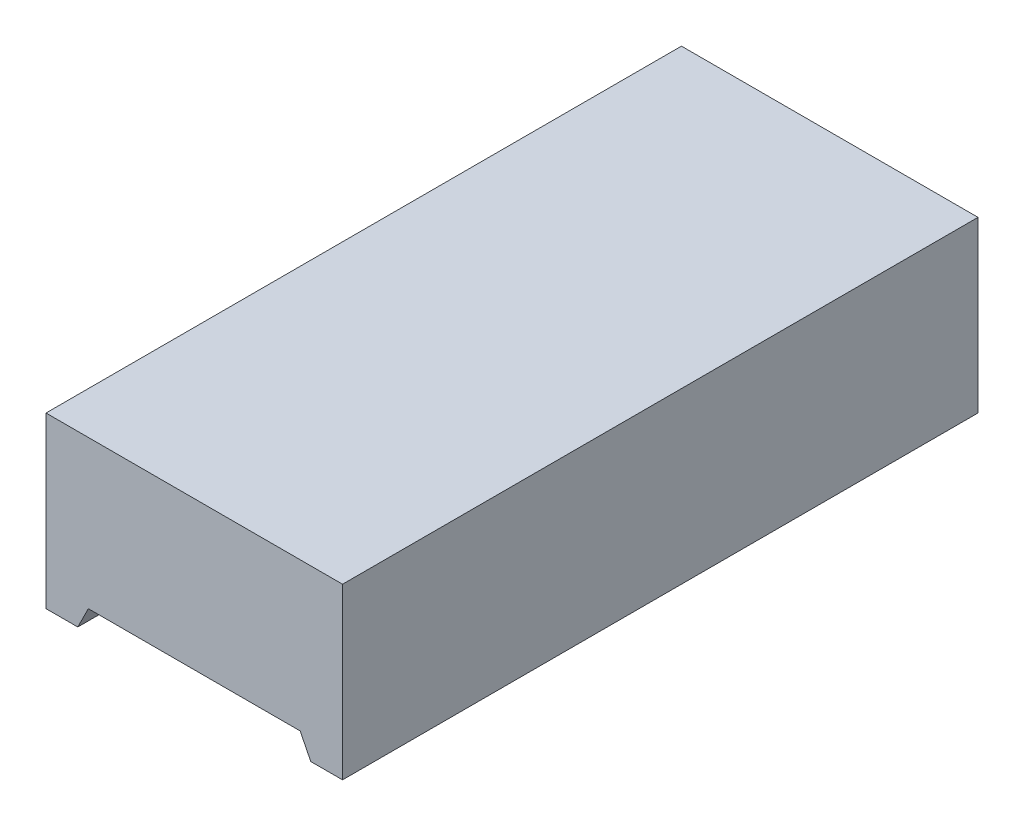
ISO-10303-21;
HEADER;
FILE_DESCRIPTION(('STEP AP214'),'2;1');
FILE_NAME('part.step','',(''),(''),'','','');
FILE_SCHEMA(('AUTOMOTIVE_DESIGN { 1 0 10303 214 1 1 1 1 }'));
ENDSEC;
DATA;
#1=APPLICATION_CONTEXT('core data for automotive mechanical design processes');
#2=APPLICATION_PROTOCOL_DEFINITION('international standard','automotive_design',2000,#1);
#3=PRODUCT_CONTEXT('',#1,'mechanical');
#4=PRODUCT('Part','Part','',(#3));
#5=PRODUCT_RELATED_PRODUCT_CATEGORY('part','',(#4));
#6=PRODUCT_DEFINITION_FORMATION('','',#4);
#7=PRODUCT_DEFINITION_CONTEXT('part definition',#1,'design');
#8=PRODUCT_DEFINITION('design','',#6,#7);
#9=PRODUCT_DEFINITION_SHAPE('','',#8);
#10=(LENGTH_UNIT() NAMED_UNIT(*) SI_UNIT(.MILLI.,.METRE.));
#11=(NAMED_UNIT(*) PLANE_ANGLE_UNIT() SI_UNIT($,.RADIAN.));
#12=(NAMED_UNIT(*) SI_UNIT($,.STERADIAN.) SOLID_ANGLE_UNIT());
#13=UNCERTAINTY_MEASURE_WITH_UNIT(LENGTH_MEASURE(1.E-05),#10,'distance_accuracy_value','');
#14=(GEOMETRIC_REPRESENTATION_CONTEXT(3) GLOBAL_UNCERTAINTY_ASSIGNED_CONTEXT((#13)) GLOBAL_UNIT_ASSIGNED_CONTEXT((#10,
#11,#12)) REPRESENTATION_CONTEXT('',''));
#15=CARTESIAN_POINT('',(0.,0.,0.));
#16=DIRECTION('',(0.,0.,1.));
#17=DIRECTION('',(1.,0.,0.));
#18=AXIS2_PLACEMENT_3D('',#15,#16,#17);
#19=CARTESIAN_POINT('',(7.,0.,15.));
#20=DIRECTION('',(0.,1.,0.));
#21=DIRECTION('',(-1.,0.,0.));
#22=AXIS2_PLACEMENT_3D('',#19,#20,#21);
#23=PLANE('',#22);
#24=DIRECTION('',(1.,0.,0.));
#25=VECTOR('',#24,1.);
#26=CARTESIAN_POINT('',(7.,0.,-15.));
#27=LINE('',#26,#25);
#28=CARTESIAN_POINT('',(5.5,0.,-15.));
#29=VERTEX_POINT('',#28);
#30=CARTESIAN_POINT('',(7.,0.,-15.));
#31=VERTEX_POINT('',#30);
#32=EDGE_CURVE('E130',#29,#31,#27,.T.);
#33=ORIENTED_EDGE('',*,*,#32,.T.);
#34=DIRECTION('',(0.,0.,-1.));
#35=VECTOR('',#34,1.);
#36=CARTESIAN_POINT('',(7.,0.,15.));
#37=LINE('',#36,#35);
#38=CARTESIAN_POINT('',(7.,0.,15.));
#39=VERTEX_POINT('',#38);
#40=EDGE_CURVE('E11',#39,#31,#37,.T.);
#41=ORIENTED_EDGE('',*,*,#40,.F.);
#42=DIRECTION('',(1.,0.,0.));
#43=VECTOR('',#42,1.);
#44=CARTESIAN_POINT('',(7.,0.,15.));
#45=LINE('',#44,#43);
#46=CARTESIAN_POINT('',(5.5,0.,15.));
#47=VERTEX_POINT('',#46);
#48=EDGE_CURVE('E144',#47,#39,#45,.T.);
#49=ORIENTED_EDGE('',*,*,#48,.F.);
#50=DIRECTION('',(0.,0.,-1.));
#51=VECTOR('',#50,1.);
#52=CARTESIAN_POINT('',(5.5,0.,15.));
#53=LINE('',#52,#51);
#54=EDGE_CURVE('E126',#47,#29,#53,.T.);
#55=ORIENTED_EDGE('',*,*,#54,.T.);
#56=EDGE_LOOP('',(#33,#41,#49,#55));
#57=FACE_BOUND('',#56,.T.);
#58=ADVANCED_FACE('F34',(#57),#23,.F.);
#59=CARTESIAN_POINT('',(7.,0.,15.));
#60=DIRECTION('',(-1.,0.,0.));
#61=DIRECTION('',(0.,-1.,0.));
#62=AXIS2_PLACEMENT_3D('',#59,#60,#61);
#63=PLANE('',#62);
#64=DIRECTION('',(0.,1.,0.));
#65=VECTOR('',#64,1.);
#66=CARTESIAN_POINT('',(7.,0.,-15.));
#67=LINE('',#66,#65);
#68=CARTESIAN_POINT('',(7.,8.,-15.));
#69=VERTEX_POINT('',#68);
#70=EDGE_CURVE('E133',#31,#69,#67,.T.);
#71=ORIENTED_EDGE('',*,*,#70,.T.);
#72=DIRECTION('',(0.,0.,-1.));
#73=VECTOR('',#72,1.);
#74=CARTESIAN_POINT('',(7.,8.,15.));
#75=LINE('',#74,#73);
#76=CARTESIAN_POINT('',(7.,8.,15.));
#77=VERTEX_POINT('',#76);
#78=EDGE_CURVE('E42',#77,#69,#75,.T.);
#79=ORIENTED_EDGE('',*,*,#78,.F.);
#80=DIRECTION('',(0.,1.,0.));
#81=VECTOR('',#80,1.);
#82=CARTESIAN_POINT('',(7.,0.,15.));
#83=LINE('',#82,#81);
#84=EDGE_CURVE('E93',#39,#77,#83,.T.);
#85=ORIENTED_EDGE('',*,*,#84,.F.);
#86=ORIENTED_EDGE('',*,*,#40,.T.);
#87=EDGE_LOOP('',(#71,#79,#85,#86));
#88=FACE_BOUND('',#87,.T.);
#89=ADVANCED_FACE('F179',(#88),#63,.F.);
#90=CARTESIAN_POINT('',(7.,8.,15.));
#91=DIRECTION('',(0.,-1.,0.));
#92=DIRECTION('',(0.,0.,-1.));
#93=AXIS2_PLACEMENT_3D('',#90,#91,#92);
#94=PLANE('',#93);
#95=DIRECTION('',(-1.,0.,0.));
#96=VECTOR('',#95,1.);
#97=CARTESIAN_POINT('',(7.,8.,-15.));
#98=LINE('',#97,#96);
#99=CARTESIAN_POINT('',(-7.,8.,-15.));
#100=VERTEX_POINT('',#99);
#101=EDGE_CURVE('E135',#69,#100,#98,.T.);
#102=ORIENTED_EDGE('',*,*,#101,.T.);
#103=DIRECTION('',(0.,0.,-1.));
#104=VECTOR('',#103,1.);
#105=CARTESIAN_POINT('',(-7.,8.,15.));
#106=LINE('',#105,#104);
#107=CARTESIAN_POINT('',(-7.,8.,15.));
#108=VERTEX_POINT('',#107);
#109=EDGE_CURVE('E151',#108,#100,#106,.T.);
#110=ORIENTED_EDGE('',*,*,#109,.F.);
#111=DIRECTION('',(-1.,0.,0.));
#112=VECTOR('',#111,1.);
#113=CARTESIAN_POINT('',(7.,8.,15.));
#114=LINE('',#113,#112);
#115=EDGE_CURVE('E159',#77,#108,#114,.T.);
#116=ORIENTED_EDGE('',*,*,#115,.F.);
#117=ORIENTED_EDGE('',*,*,#78,.T.);
#118=EDGE_LOOP('',(#102,#110,#116,#117));
#119=FACE_BOUND('',#118,.T.);
#120=ADVANCED_FACE('F157',(#119),#94,.F.);
#121=CARTESIAN_POINT('',(-7.,0.,15.));
#122=DIRECTION('',(1.,0.,0.));
#123=DIRECTION('',(0.,1.,0.));
#124=AXIS2_PLACEMENT_3D('',#121,#122,#123);
#125=PLANE('',#124);
#126=DIRECTION('',(0.,-1.,0.));
#127=VECTOR('',#126,1.);
#128=CARTESIAN_POINT('',(-7.,0.,-15.));
#129=LINE('',#128,#127);
#130=CARTESIAN_POINT('',(-7.,0.,-15.));
#131=VERTEX_POINT('',#130);
#132=EDGE_CURVE('E137',#100,#131,#129,.T.);
#133=ORIENTED_EDGE('',*,*,#132,.T.);
#134=DIRECTION('',(0.,0.,-1.));
#135=VECTOR('',#134,1.);
#136=CARTESIAN_POINT('',(-7.,0.,15.));
#137=LINE('',#136,#135);
#138=CARTESIAN_POINT('',(-7.,0.,15.));
#139=VERTEX_POINT('',#138);
#140=EDGE_CURVE('E148',#139,#131,#137,.T.);
#141=ORIENTED_EDGE('',*,*,#140,.F.);
#142=DIRECTION('',(0.,-1.,0.));
#143=VECTOR('',#142,1.);
#144=CARTESIAN_POINT('',(-7.,0.,15.));
#145=LINE('',#144,#143);
#146=EDGE_CURVE('E171',#108,#139,#145,.T.);
#147=ORIENTED_EDGE('',*,*,#146,.F.);
#148=ORIENTED_EDGE('',*,*,#109,.T.);
#149=EDGE_LOOP('',(#133,#141,#147,#148));
#150=FACE_BOUND('',#149,.T.);
#151=ADVANCED_FACE('F167',(#150),#125,.F.);
#152=CARTESIAN_POINT('',(-7.,0.,15.));
#153=DIRECTION('',(0.,1.,0.));
#154=DIRECTION('',(-1.,0.,0.));
#155=AXIS2_PLACEMENT_3D('',#152,#153,#154);
#156=PLANE('',#155);
#157=DIRECTION('',(1.,0.,0.));
#158=VECTOR('',#157,1.);
#159=CARTESIAN_POINT('',(-7.,0.,-15.));
#160=LINE('',#159,#158);
#161=CARTESIAN_POINT('',(-5.5,0.,-15.));
#162=VERTEX_POINT('',#161);
#163=EDGE_CURVE('E139',#131,#162,#160,.T.);
#164=ORIENTED_EDGE('',*,*,#163,.T.);
#165=DIRECTION('',(0.,0.,-1.));
#166=VECTOR('',#165,1.);
#167=CARTESIAN_POINT('',(-5.5,0.,15.));
#168=LINE('',#167,#166);
#169=CARTESIAN_POINT('',(-5.5,0.,15.));
#170=VERTEX_POINT('',#169);
#171=EDGE_CURVE('E121',#170,#162,#168,.T.);
#172=ORIENTED_EDGE('',*,*,#171,.F.);
#173=DIRECTION('',(1.,0.,0.));
#174=VECTOR('',#173,1.);
#175=CARTESIAN_POINT('',(-7.,0.,15.));
#176=LINE('',#175,#174);
#177=EDGE_CURVE('E112',#139,#170,#176,.T.);
#178=ORIENTED_EDGE('',*,*,#177,.F.);
#179=ORIENTED_EDGE('',*,*,#140,.T.);
#180=EDGE_LOOP('',(#164,#172,#178,#179));
#181=FACE_BOUND('',#180,.T.);
#182=ADVANCED_FACE('F170',(#181),#156,.F.);
#183=CARTESIAN_POINT('',(-5.5,0.,15.));
#184=DIRECTION('',(-0.894427190999916,0.447213595499957,0.));
#185=DIRECTION('',(-0.447213595499957,-0.894427190999917,0.));
#186=AXIS2_PLACEMENT_3D('',#183,#184,#185);
#187=PLANE('',#186);
#188=DIRECTION('',(0.447213595499957,0.894427190999916,0.));
#189=VECTOR('',#188,1.);
#190=CARTESIAN_POINT('',(-5.5,0.,-15.));
#191=LINE('',#190,#189);
#192=CARTESIAN_POINT('',(-5.,1.,-15.));
#193=VERTEX_POINT('',#192);
#194=EDGE_CURVE('E120',#162,#193,#191,.T.);
#195=ORIENTED_EDGE('',*,*,#194,.T.);
#196=DIRECTION('',(0.,0.,-1.));
#197=VECTOR('',#196,1.);
#198=CARTESIAN_POINT('',(-5.,1.,15.));
#199=LINE('',#198,#197);
#200=CARTESIAN_POINT('',(-5.,1.,15.));
#201=VERTEX_POINT('',#200);
#202=EDGE_CURVE('E117',#201,#193,#199,.T.);
#203=ORIENTED_EDGE('',*,*,#202,.F.);
#204=DIRECTION('',(0.447213595499957,0.894427190999916,0.));
#205=VECTOR('',#204,1.);
#206=CARTESIAN_POINT('',(-5.5,0.,15.));
#207=LINE('',#206,#205);
#208=EDGE_CURVE('E106',#170,#201,#207,.T.);
#209=ORIENTED_EDGE('',*,*,#208,.F.);
#210=ORIENTED_EDGE('',*,*,#171,.T.);
#211=EDGE_LOOP('',(#195,#203,#209,#210));
#212=FACE_BOUND('',#211,.T.);
#213=ADVANCED_FACE('F118',(#212),#187,.F.);
#214=CARTESIAN_POINT('',(5.,1.,15.));
#215=DIRECTION('',(0.,1.,0.));
#216=DIRECTION('',(0.,0.,1.));
#217=AXIS2_PLACEMENT_3D('',#214,#215,#216);
#218=PLANE('',#217);
#219=DIRECTION('',(1.,0.,0.));
#220=VECTOR('',#219,1.);
#221=CARTESIAN_POINT('',(5.,1.,-15.));
#222=LINE('',#221,#220);
#223=CARTESIAN_POINT('',(5.,1.,-15.));
#224=VERTEX_POINT('',#223);
#225=EDGE_CURVE('E79',#193,#224,#222,.T.);
#226=ORIENTED_EDGE('',*,*,#225,.T.);
#227=DIRECTION('',(0.,0.,-1.));
#228=VECTOR('',#227,1.);
#229=CARTESIAN_POINT('',(5.,1.,15.));
#230=LINE('',#229,#228);
#231=CARTESIAN_POINT('',(5.,1.,15.));
#232=VERTEX_POINT('',#231);
#233=EDGE_CURVE('E122',#232,#224,#230,.T.);
#234=ORIENTED_EDGE('',*,*,#233,.F.);
#235=DIRECTION('',(1.,0.,0.));
#236=VECTOR('',#235,1.);
#237=CARTESIAN_POINT('',(5.,1.,15.));
#238=LINE('',#237,#236);
#239=EDGE_CURVE('E110',#201,#232,#238,.T.);
#240=ORIENTED_EDGE('',*,*,#239,.F.);
#241=ORIENTED_EDGE('',*,*,#202,.T.);
#242=EDGE_LOOP('',(#226,#234,#240,#241));
#243=FACE_BOUND('',#242,.T.);
#244=ADVANCED_FACE('F124',(#243),#218,.F.);
#245=CARTESIAN_POINT('',(5.5,0.,15.));
#246=DIRECTION('',(0.894427190999916,0.447213595499957,0.));
#247=DIRECTION('',(-0.447213595499957,0.894427190999917,0.));
#248=AXIS2_PLACEMENT_3D('',#245,#246,#247);
#249=PLANE('',#248);
#250=DIRECTION('',(0.447213595499957,-0.894427190999916,0.));
#251=VECTOR('',#250,1.);
#252=CARTESIAN_POINT('',(5.5,0.,-15.));
#253=LINE('',#252,#251);
#254=EDGE_CURVE('E85',#224,#29,#253,.T.);
#255=ORIENTED_EDGE('',*,*,#254,.T.);
#256=ORIENTED_EDGE('',*,*,#54,.F.);
#257=DIRECTION('',(0.447213595499957,-0.894427190999916,0.));
#258=VECTOR('',#257,1.);
#259=CARTESIAN_POINT('',(5.5,0.,15.));
#260=LINE('',#259,#258);
#261=EDGE_CURVE('E50',#232,#47,#260,.T.);
#262=ORIENTED_EDGE('',*,*,#261,.F.);
#263=ORIENTED_EDGE('',*,*,#233,.T.);
#264=EDGE_LOOP('',(#255,#256,#262,#263));
#265=FACE_BOUND('',#264,.T.);
#266=ADVANCED_FACE('F195',(#265),#249,.F.);
#267=CARTESIAN_POINT('',(0.,0.,15.));
#268=DIRECTION('',(0.,0.,-1.));
#269=DIRECTION('',(-1.,0.,0.));
#270=AXIS2_PLACEMENT_3D('',#267,#268,#269);
#271=PLANE('',#270);
#272=ORIENTED_EDGE('',*,*,#48,.T.);
#273=ORIENTED_EDGE('',*,*,#84,.T.);
#274=ORIENTED_EDGE('',*,*,#115,.T.);
#275=ORIENTED_EDGE('',*,*,#146,.T.);
#276=ORIENTED_EDGE('',*,*,#177,.T.);
#277=ORIENTED_EDGE('',*,*,#208,.T.);
#278=ORIENTED_EDGE('',*,*,#239,.T.);
#279=ORIENTED_EDGE('',*,*,#261,.T.);
#280=EDGE_LOOP('',(#272,#273,#274,#275,#276,#277,#278,#279));
#281=FACE_BOUND('',#280,.T.);
#282=ADVANCED_FACE('F108',(#281),#271,.F.);
#283=CARTESIAN_POINT('',(0.,0.,-15.));
#284=DIRECTION('',(0.,0.,-1.));
#285=DIRECTION('',(-1.,0.,0.));
#286=AXIS2_PLACEMENT_3D('',#283,#284,#285);
#287=PLANE('',#286);
#288=ORIENTED_EDGE('',*,*,#32,.F.);
#289=ORIENTED_EDGE('',*,*,#254,.F.);
#290=ORIENTED_EDGE('',*,*,#225,.F.);
#291=ORIENTED_EDGE('',*,*,#194,.F.);
#292=ORIENTED_EDGE('',*,*,#163,.F.);
#293=ORIENTED_EDGE('',*,*,#132,.F.);
#294=ORIENTED_EDGE('',*,*,#101,.F.);
#295=ORIENTED_EDGE('',*,*,#70,.F.);
#296=EDGE_LOOP('',(#288,#289,#290,#291,#292,#293,#294,#295));
#297=FACE_BOUND('',#296,.T.);
#298=ADVANCED_FACE('F163',(#297),#287,.T.);
#299=CLOSED_SHELL('',(#58,#89,#120,#151,#182,#213,#244,#266,#282,#298));
#300=MANIFOLD_SOLID_BREP('B2',#299);
#301=ADVANCED_BREP_SHAPE_REPRESENTATION('',(#18,#300),#14);
#302=SHAPE_DEFINITION_REPRESENTATION(#9,#301);
ENDSEC;
END-ISO-10303-21;
